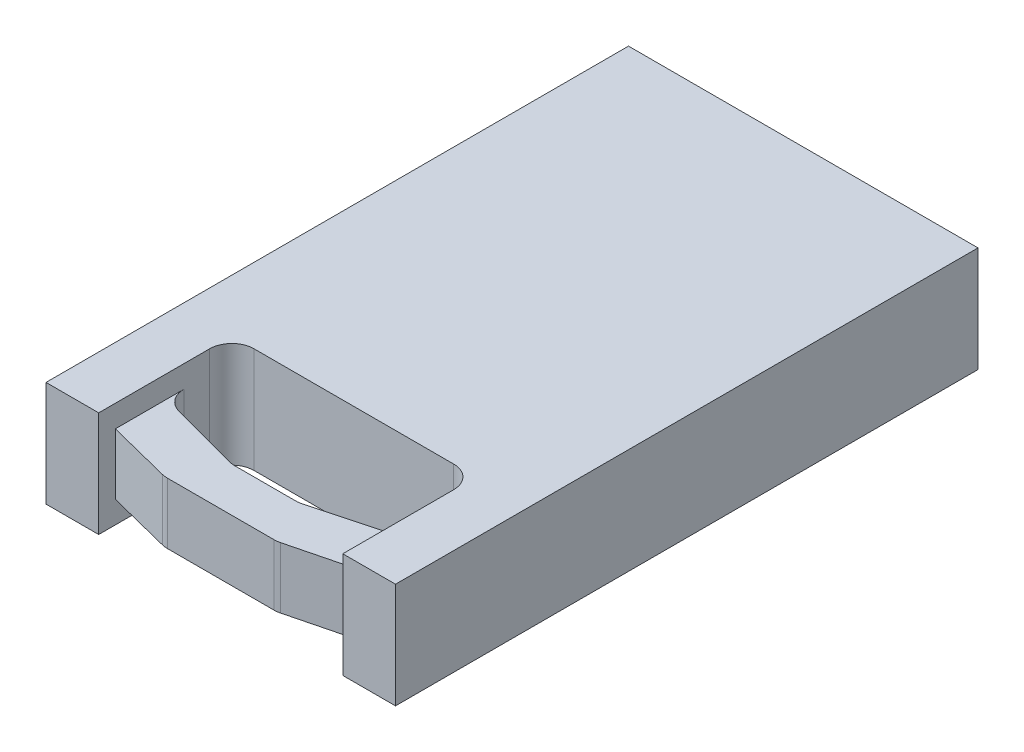
ISO-10303-21;
HEADER;
FILE_DESCRIPTION(('STEP AP214'),'2;1');
FILE_NAME('part.step','',(''),(''),'','','');
FILE_SCHEMA(('AUTOMOTIVE_DESIGN { 1 0 10303 214 1 1 1 1 }'));
ENDSEC;
DATA;
#1=APPLICATION_CONTEXT('core data for automotive mechanical design processes');
#2=APPLICATION_PROTOCOL_DEFINITION('international standard','automotive_design',2000,#1);
#3=PRODUCT_CONTEXT('',#1,'mechanical');
#4=PRODUCT('Part','Part','',(#3));
#5=PRODUCT_RELATED_PRODUCT_CATEGORY('part','',(#4));
#6=PRODUCT_DEFINITION_FORMATION('','',#4);
#7=PRODUCT_DEFINITION_CONTEXT('part definition',#1,'design');
#8=PRODUCT_DEFINITION('design','',#6,#7);
#9=PRODUCT_DEFINITION_SHAPE('','',#8);
#10=(LENGTH_UNIT() NAMED_UNIT(*) SI_UNIT(.MILLI.,.METRE.));
#11=(NAMED_UNIT(*) PLANE_ANGLE_UNIT() SI_UNIT($,.RADIAN.));
#12=(NAMED_UNIT(*) SI_UNIT($,.STERADIAN.) SOLID_ANGLE_UNIT());
#13=UNCERTAINTY_MEASURE_WITH_UNIT(LENGTH_MEASURE(1.E-05),#10,'distance_accuracy_value','');
#14=(GEOMETRIC_REPRESENTATION_CONTEXT(3) GLOBAL_UNCERTAINTY_ASSIGNED_CONTEXT((#13)) GLOBAL_UNIT_ASSIGNED_CONTEXT((#10,
#11,#12)) REPRESENTATION_CONTEXT('',''));
#15=CARTESIAN_POINT('',(0.,0.,0.));
#16=DIRECTION('',(0.,0.,1.));
#17=DIRECTION('',(1.,0.,0.));
#18=AXIS2_PLACEMENT_3D('',#15,#16,#17);
#19=CARTESIAN_POINT('',(-209.55,60.325,166.6875));
#20=DIRECTION('',(0.,0.,-1.));
#21=DIRECTION('',(-1.,0.,0.));
#22=AXIS2_PLACEMENT_3D('',#19,#20,#21);
#23=PLANE('',#22);
#24=DIRECTION('',(0.,1.,0.));
#25=VECTOR('',#24,1.);
#26=CARTESIAN_POINT('',(-100.0125,0.,166.6875));
#27=LINE('',#26,#25);
#28=CARTESIAN_POINT('',(-100.0125,0.,166.6875));
#29=VERTEX_POINT('',#28);
#30=CARTESIAN_POINT('',(-100.0125,60.325,166.6875));
#31=VERTEX_POINT('',#30);
#32=EDGE_CURVE('E382',#29,#31,#27,.T.);
#33=ORIENTED_EDGE('',*,*,#32,.F.);
#34=DIRECTION('',(1.,0.,0.));
#35=VECTOR('',#34,1.);
#36=CARTESIAN_POINT('',(-209.55,0.,166.6875));
#37=LINE('',#36,#35);
#38=CARTESIAN_POINT('',(-69.85,0.,166.6875));
#39=VERTEX_POINT('',#38);
#40=EDGE_CURVE('E215',#29,#39,#37,.T.);
#41=ORIENTED_EDGE('',*,*,#40,.T.);
#42=DIRECTION('',(0.,1.,0.));
#43=VECTOR('',#42,1.);
#44=CARTESIAN_POINT('',(-69.85,0.,166.6875));
#45=LINE('',#44,#43);
#46=CARTESIAN_POINT('',(-69.85,60.325,166.6875));
#47=VERTEX_POINT('',#46);
#48=EDGE_CURVE('E336',#39,#47,#45,.T.);
#49=ORIENTED_EDGE('',*,*,#48,.T.);
#50=DIRECTION('',(1.,0.,0.));
#51=VECTOR('',#50,1.);
#52=CARTESIAN_POINT('',(-209.55,60.325,166.6875));
#53=LINE('',#52,#51);
#54=EDGE_CURVE('E221',#31,#47,#53,.T.);
#55=ORIENTED_EDGE('',*,*,#54,.F.);
#56=EDGE_LOOP('',(#33,#41,#49,#55));
#57=FACE_BOUND('',#56,.T.);
#58=ADVANCED_FACE('F33',(#57),#23,.F.);
#59=DIRECTION('',(0.,1.,0.));
#60=VECTOR('',#59,1.);
#61=CARTESIAN_POINT('',(100.0125,0.,166.6875));
#62=LINE('',#61,#60);
#63=CARTESIAN_POINT('',(100.0125,0.,166.6875));
#64=VERTEX_POINT('',#63);
#65=CARTESIAN_POINT('',(100.0125,60.325,166.6875));
#66=VERTEX_POINT('',#65);
#67=EDGE_CURVE('E48',#64,#66,#62,.T.);
#68=ORIENTED_EDGE('',*,*,#67,.T.);
#69=CARTESIAN_POINT('',(69.8500000000001,60.325,166.6875));
#70=VERTEX_POINT('',#69);
#71=EDGE_CURVE('E352',#70,#66,#53,.T.);
#72=ORIENTED_EDGE('',*,*,#71,.F.);
#73=DIRECTION('',(0.,1.,0.));
#74=VECTOR('',#73,1.);
#75=CARTESIAN_POINT('',(69.8500000000001,0.,166.6875));
#76=LINE('',#75,#74);
#77=CARTESIAN_POINT('',(69.8500000000001,0.,166.6875));
#78=VERTEX_POINT('',#77);
#79=EDGE_CURVE('E343',#78,#70,#76,.T.);
#80=ORIENTED_EDGE('',*,*,#79,.F.);
#81=EDGE_CURVE('E212',#78,#64,#37,.T.);
#82=ORIENTED_EDGE('',*,*,#81,.T.);
#83=EDGE_LOOP('',(#68,#72,#80,#82));
#84=FACE_BOUND('',#83,.T.);
#85=ADVANCED_FACE('F380',(#84),#23,.F.);
#86=CARTESIAN_POINT('',(-209.55,60.325,-166.6875));
#87=DIRECTION('',(0.,0.,1.));
#88=DIRECTION('',(1.,0.,0.));
#89=AXIS2_PLACEMENT_3D('',#86,#87,#88);
#90=PLANE('',#89);
#91=DIRECTION('',(0.,1.,0.));
#92=VECTOR('',#91,1.);
#93=CARTESIAN_POINT('',(100.0125,0.,-166.6875));
#94=LINE('',#93,#92);
#95=CARTESIAN_POINT('',(100.0125,0.,-166.6875));
#96=VERTEX_POINT('',#95);
#97=CARTESIAN_POINT('',(100.0125,60.325,-166.6875));
#98=VERTEX_POINT('',#97);
#99=EDGE_CURVE('E193',#96,#98,#94,.T.);
#100=ORIENTED_EDGE('',*,*,#99,.F.);
#101=DIRECTION('',(-1.,0.,0.));
#102=VECTOR('',#101,1.);
#103=CARTESIAN_POINT('',(-209.55,0.,-166.6875));
#104=LINE('',#103,#102);
#105=CARTESIAN_POINT('',(-100.0125,0.,-166.6875));
#106=VERTEX_POINT('',#105);
#107=EDGE_CURVE('E206',#96,#106,#104,.T.);
#108=ORIENTED_EDGE('',*,*,#107,.T.);
#109=DIRECTION('',(0.,1.,0.));
#110=VECTOR('',#109,1.);
#111=CARTESIAN_POINT('',(-100.0125,0.,-166.6875));
#112=LINE('',#111,#110);
#113=CARTESIAN_POINT('',(-100.0125,60.325,-166.6875));
#114=VERTEX_POINT('',#113);
#115=EDGE_CURVE('E56',#106,#114,#112,.T.);
#116=ORIENTED_EDGE('',*,*,#115,.T.);
#117=DIRECTION('',(-1.,0.,0.));
#118=VECTOR('',#117,1.);
#119=CARTESIAN_POINT('',(-209.55,60.325,-166.6875));
#120=LINE('',#119,#118);
#121=EDGE_CURVE('E208',#98,#114,#120,.T.);
#122=ORIENTED_EDGE('',*,*,#121,.F.);
#123=EDGE_LOOP('',(#100,#108,#116,#122));
#124=FACE_BOUND('',#123,.T.);
#125=ADVANCED_FACE('F205',(#124),#90,.F.);
#126=CARTESIAN_POINT('',(0.,60.325,0.));
#127=DIRECTION('',(0.,-1.,0.));
#128=DIRECTION('',(0.,0.,-1.));
#129=AXIS2_PLACEMENT_3D('',#126,#127,#128);
#130=PLANE('',#129);
#131=DIRECTION('',(0.,0.,-1.));
#132=VECTOR('',#131,1.);
#133=CARTESIAN_POINT('',(100.0125,60.325,166.6875));
#134=LINE('',#133,#132);
#135=EDGE_CURVE('E530',#66,#98,#134,.T.);
#136=ORIENTED_EDGE('',*,*,#135,.T.);
#137=ORIENTED_EDGE('',*,*,#121,.T.);
#138=DIRECTION('',(0.,0.,1.));
#139=VECTOR('',#138,1.);
#140=CARTESIAN_POINT('',(-100.0125,60.325,166.6875));
#141=LINE('',#140,#139);
#142=EDGE_CURVE('E200',#114,#31,#141,.T.);
#143=ORIENTED_EDGE('',*,*,#142,.T.);
#144=ORIENTED_EDGE('',*,*,#54,.T.);
#145=DIRECTION('',(0.,0.,1.));
#146=VECTOR('',#145,1.);
#147=CARTESIAN_POINT('',(-69.85,60.325,166.6875));
#148=LINE('',#147,#146);
#149=CARTESIAN_POINT('',(-69.85,60.325,103.1875));
#150=VERTEX_POINT('',#149);
#151=EDGE_CURVE('E340',#150,#47,#148,.T.);
#152=ORIENTED_EDGE('',*,*,#151,.F.);
#153=CARTESIAN_POINT('',(-57.15,60.325,103.1875));
#154=DIRECTION('',(0.,-1.,0.));
#155=DIRECTION('',(0.,0.,-1.));
#156=AXIS2_PLACEMENT_3D('',#153,#154,#155);
#157=CIRCLE('',#156,12.7);
#158=CARTESIAN_POINT('',(-57.15,60.325,90.4875));
#159=VERTEX_POINT('',#158);
#160=EDGE_CURVE('E270',#150,#159,#157,.T.);
#161=ORIENTED_EDGE('',*,*,#160,.T.);
#162=DIRECTION('',(-1.,0.,0.));
#163=VECTOR('',#162,1.);
#164=CARTESIAN_POINT('',(-69.85,60.325,90.4875));
#165=LINE('',#164,#163);
#166=CARTESIAN_POINT('',(57.15,60.325,90.4875));
#167=VERTEX_POINT('',#166);
#168=EDGE_CURVE('E218',#167,#159,#165,.T.);
#169=ORIENTED_EDGE('',*,*,#168,.F.);
#170=CARTESIAN_POINT('',(57.15,60.325,103.1875));
#171=DIRECTION('',(0.,-1.,0.));
#172=DIRECTION('',(0.,0.,-1.));
#173=AXIS2_PLACEMENT_3D('',#170,#171,#172);
#174=CIRCLE('',#173,12.7);
#175=CARTESIAN_POINT('',(69.85,60.325,103.1875));
#176=VERTEX_POINT('',#175);
#177=EDGE_CURVE('E265',#167,#176,#174,.T.);
#178=ORIENTED_EDGE('',*,*,#177,.T.);
#179=DIRECTION('',(0.,0.,-1.));
#180=VECTOR('',#179,1.);
#181=CARTESIAN_POINT('',(69.8500000000001,60.325,166.6875));
#182=LINE('',#181,#180);
#183=EDGE_CURVE('E332',#70,#176,#182,.T.);
#184=ORIENTED_EDGE('',*,*,#183,.F.);
#185=ORIENTED_EDGE('',*,*,#71,.T.);
#186=EDGE_LOOP('',(#136,#137,#143,#144,#152,#161,#169,#178,#184,#185));
#187=FACE_BOUND('',#186,.T.);
#188=ADVANCED_FACE('F359',(#187),#130,.F.);
#189=CARTESIAN_POINT('',(0.,0.,0.));
#190=DIRECTION('',(0.,-1.,0.));
#191=DIRECTION('',(0.,0.,-1.));
#192=AXIS2_PLACEMENT_3D('',#189,#190,#191);
#193=PLANE('',#192);
#194=ORIENTED_EDGE('',*,*,#107,.F.);
#195=DIRECTION('',(0.,0.,-1.));
#196=VECTOR('',#195,1.);
#197=CARTESIAN_POINT('',(100.0125,0.,166.6875));
#198=LINE('',#197,#196);
#199=EDGE_CURVE('E190',#64,#96,#198,.T.);
#200=ORIENTED_EDGE('',*,*,#199,.F.);
#201=ORIENTED_EDGE('',*,*,#81,.F.);
#202=DIRECTION('',(0.,0.,-1.));
#203=VECTOR('',#202,1.);
#204=CARTESIAN_POINT('',(69.8500000000001,0.,166.6875));
#205=LINE('',#204,#203);
#206=CARTESIAN_POINT('',(69.85,0.,103.1875));
#207=VERTEX_POINT('',#206);
#208=EDGE_CURVE('E347',#78,#207,#205,.T.);
#209=ORIENTED_EDGE('',*,*,#208,.T.);
#210=CARTESIAN_POINT('',(57.15,0.,103.1875));
#211=DIRECTION('',(0.,-1.,0.));
#212=DIRECTION('',(0.,0.,-1.));
#213=AXIS2_PLACEMENT_3D('',#210,#211,#212);
#214=CIRCLE('',#213,12.7);
#215=CARTESIAN_POINT('',(57.15,0.,90.4875));
#216=VERTEX_POINT('',#215);
#217=EDGE_CURVE('E268',#207,#216,#214,.F.);
#218=ORIENTED_EDGE('',*,*,#217,.T.);
#219=DIRECTION('',(-1.,0.,0.));
#220=VECTOR('',#219,1.);
#221=CARTESIAN_POINT('',(-69.85,0.,90.4875));
#222=LINE('',#221,#220);
#223=CARTESIAN_POINT('',(-57.15,0.,90.4875));
#224=VERTEX_POINT('',#223);
#225=EDGE_CURVE('E213',#216,#224,#222,.T.);
#226=ORIENTED_EDGE('',*,*,#225,.T.);
#227=CARTESIAN_POINT('',(-57.15,0.,103.1875));
#228=DIRECTION('',(0.,-1.,0.));
#229=DIRECTION('',(0.,0.,-1.));
#230=AXIS2_PLACEMENT_3D('',#227,#228,#229);
#231=CIRCLE('',#230,12.7);
#232=CARTESIAN_POINT('',(-69.85,0.,103.1875));
#233=VERTEX_POINT('',#232);
#234=EDGE_CURVE('E272',#224,#233,#231,.F.);
#235=ORIENTED_EDGE('',*,*,#234,.T.);
#236=DIRECTION('',(0.,0.,1.));
#237=VECTOR('',#236,1.);
#238=CARTESIAN_POINT('',(-69.85,0.,166.6875));
#239=LINE('',#238,#237);
#240=EDGE_CURVE('E337',#233,#39,#239,.T.);
#241=ORIENTED_EDGE('',*,*,#240,.T.);
#242=ORIENTED_EDGE('',*,*,#40,.F.);
#243=DIRECTION('',(0.,0.,1.));
#244=VECTOR('',#243,1.);
#245=CARTESIAN_POINT('',(-100.0125,0.,166.6875));
#246=LINE('',#245,#244);
#247=EDGE_CURVE('E199',#106,#29,#246,.T.);
#248=ORIENTED_EDGE('',*,*,#247,.F.);
#249=EDGE_LOOP('',(#194,#200,#201,#209,#218,#226,#235,#241,#242,#248));
#250=FACE_BOUND('',#249,.T.);
#251=ADVANCED_FACE('F210',(#250),#193,.T.);
#252=DIRECTION('',(-1.,0.,0.));
#253=VECTOR('',#252,1.);
#254=CARTESIAN_POINT('',(-69.85,12.7,166.6875));
#255=LINE('',#254,#253);
#256=CARTESIAN_POINT('',(30.5887182557428,12.7,166.6875));
#257=VERTEX_POINT('',#256);
#258=CARTESIAN_POINT('',(-30.588718255743,12.7,166.6875));
#259=VERTEX_POINT('',#258);
#260=EDGE_CURVE('E392',#257,#259,#255,.T.);
#261=ORIENTED_EDGE('',*,*,#260,.F.);
#262=DIRECTION('',(0.,1.,0.));
#263=VECTOR('',#262,1.);
#264=CARTESIAN_POINT('',(30.5887182557428,60.325,166.6875));
#265=LINE('',#264,#263);
#266=CARTESIAN_POINT('',(30.5887182557428,47.625,166.6875));
#267=VERTEX_POINT('',#266);
#268=EDGE_CURVE('E227',#257,#267,#265,.T.);
#269=ORIENTED_EDGE('',*,*,#268,.T.);
#270=DIRECTION('',(1.,0.,0.));
#271=VECTOR('',#270,1.);
#272=CARTESIAN_POINT('',(-69.85,47.625,166.6875));
#273=LINE('',#272,#271);
#274=CARTESIAN_POINT('',(-30.588718255743,47.625,166.6875));
#275=VERTEX_POINT('',#274);
#276=EDGE_CURVE('E297',#275,#267,#273,.T.);
#277=ORIENTED_EDGE('',*,*,#276,.F.);
#278=DIRECTION('',(0.,1.,0.));
#279=VECTOR('',#278,1.);
#280=CARTESIAN_POINT('',(-30.588718255743,60.325,166.6875));
#281=LINE('',#280,#279);
#282=EDGE_CURVE('E224',#275,#259,#281,.F.);
#283=ORIENTED_EDGE('',*,*,#282,.T.);
#284=EDGE_LOOP('',(#261,#269,#277,#283));
#285=FACE_BOUND('',#284,.T.);
#286=ADVANCED_FACE('F464',(#285),#23,.F.);
#287=CARTESIAN_POINT('',(69.85,0.,157.1625));
#288=DIRECTION('',(-0.245071510184318,0.,-0.969505005090731));
#289=DIRECTION('',(-0.969505005090731,0.,0.245071510184318));
#290=AXIS2_PLACEMENT_3D('',#287,#288,#289);
#291=PLANE('',#290);
#292=DIRECTION('',(-0.969505005090731,0.,0.245071510184318));
#293=VECTOR('',#292,1.);
#294=CARTESIAN_POINT('',(69.85,12.7,157.1625));
#295=LINE('',#294,#293);
#296=CARTESIAN_POINT('',(69.85,12.7,157.1625));
#297=VERTEX_POINT('',#296);
#298=CARTESIAN_POINT('',(33.7011264350836,12.7,166.300213564652));
#299=VERTEX_POINT('',#298);
#300=EDGE_CURVE('E298',#297,#299,#295,.T.);
#301=ORIENTED_EDGE('',*,*,#300,.F.);
#302=DIRECTION('',(0.,1.,0.));
#303=VECTOR('',#302,1.);
#304=CARTESIAN_POINT('',(69.85,0.,157.1625));
#305=LINE('',#304,#303);
#306=CARTESIAN_POINT('',(69.8500000000001,47.625,157.1625));
#307=VERTEX_POINT('',#306);
#308=EDGE_CURVE('E349',#297,#307,#305,.T.);
#309=ORIENTED_EDGE('',*,*,#308,.T.);
#310=DIRECTION('',(-0.969505005090731,0.,0.245071510184318));
#311=VECTOR('',#310,1.);
#312=CARTESIAN_POINT('',(69.85,47.625,157.1625));
#313=LINE('',#312,#311);
#314=CARTESIAN_POINT('',(33.7011264350836,47.625,166.300213564652));
#315=VERTEX_POINT('',#314);
#316=EDGE_CURVE('E330',#307,#315,#313,.T.);
#317=ORIENTED_EDGE('',*,*,#316,.T.);
#318=DIRECTION('',(0.,1.,0.));
#319=VECTOR('',#318,1.);
#320=CARTESIAN_POINT('',(33.7011264350836,0.,166.300213564652));
#321=LINE('',#320,#319);
#322=EDGE_CURVE('E229',#315,#299,#321,.F.);
#323=ORIENTED_EDGE('',*,*,#322,.T.);
#324=EDGE_LOOP('',(#301,#309,#317,#323));
#325=FACE_BOUND('',#324,.T.);
#326=ADVANCED_FACE('F420',(#325),#291,.F.);
#327=CARTESIAN_POINT('',(-69.85,0.,157.1625));
#328=DIRECTION('',(0.245071510184315,0.,-0.969505005090731));
#329=DIRECTION('',(-0.969505005090731,0.,-0.245071510184316));
#330=AXIS2_PLACEMENT_3D('',#327,#328,#329);
#331=PLANE('',#330);
#332=DIRECTION('',(-0.969505005090731,0.,-0.245071510184316));
#333=VECTOR('',#332,1.);
#334=CARTESIAN_POINT('',(-69.85,12.7,157.1625));
#335=LINE('',#334,#333);
#336=CARTESIAN_POINT('',(-33.7011264350838,12.7,166.300213564652));
#337=VERTEX_POINT('',#336);
#338=CARTESIAN_POINT('',(-69.85,12.7,157.1625));
#339=VERTEX_POINT('',#338);
#340=EDGE_CURVE('E409',#337,#339,#335,.T.);
#341=ORIENTED_EDGE('',*,*,#340,.F.);
#342=DIRECTION('',(0.,1.,0.));
#343=VECTOR('',#342,1.);
#344=CARTESIAN_POINT('',(-33.7011264350838,0.,166.300213564652));
#345=LINE('',#344,#343);
#346=CARTESIAN_POINT('',(-33.7011264350838,47.625,166.300213564652));
#347=VERTEX_POINT('',#346);
#348=EDGE_CURVE('E232',#337,#347,#345,.T.);
#349=ORIENTED_EDGE('',*,*,#348,.T.);
#350=DIRECTION('',(-0.969505005090731,0.,-0.245071510184316));
#351=VECTOR('',#350,1.);
#352=CARTESIAN_POINT('',(-69.85,47.625,157.1625));
#353=LINE('',#352,#351);
#354=CARTESIAN_POINT('',(-69.85,47.625,157.1625));
#355=VERTEX_POINT('',#354);
#356=EDGE_CURVE('E326',#347,#355,#353,.T.);
#357=ORIENTED_EDGE('',*,*,#356,.T.);
#358=DIRECTION('',(0.,1.,0.));
#359=VECTOR('',#358,1.);
#360=CARTESIAN_POINT('',(-69.85,0.,157.1625));
#361=LINE('',#360,#359);
#362=EDGE_CURVE('E296',#339,#355,#361,.T.);
#363=ORIENTED_EDGE('',*,*,#362,.F.);
#364=EDGE_LOOP('',(#341,#349,#357,#363));
#365=FACE_BOUND('',#364,.T.);
#366=ADVANCED_FACE('F456',(#365),#331,.F.);
#367=CARTESIAN_POINT('',(-69.85,0.,141.2875));
#368=DIRECTION('',(0.,0.,1.));
#369=DIRECTION('',(1.,0.,0.));
#370=AXIS2_PLACEMENT_3D('',#367,#368,#369);
#371=PLANE('',#370);
#372=DIRECTION('',(1.,0.,0.));
#373=VECTOR('',#372,1.);
#374=CARTESIAN_POINT('',(-69.85,12.7,141.2875));
#375=LINE('',#374,#373);
#376=CARTESIAN_POINT('',(-17.3780132806406,12.7,141.2875));
#377=VERTEX_POINT('',#376);
#378=CARTESIAN_POINT('',(17.3780132806408,12.7,141.2875));
#379=VERTEX_POINT('',#378);
#380=EDGE_CURVE('E398',#377,#379,#375,.T.);
#381=ORIENTED_EDGE('',*,*,#380,.F.);
#382=DIRECTION('',(0.,-1.,0.));
#383=VECTOR('',#382,1.);
#384=CARTESIAN_POINT('',(-17.3780132806406,60.325,141.2875));
#385=LINE('',#384,#383);
#386=CARTESIAN_POINT('',(-17.3780132806406,47.625,141.2875));
#387=VERTEX_POINT('',#386);
#388=EDGE_CURVE('E244',#377,#387,#385,.F.);
#389=ORIENTED_EDGE('',*,*,#388,.T.);
#390=DIRECTION('',(1.,0.,0.));
#391=VECTOR('',#390,1.);
#392=CARTESIAN_POINT('',(-69.85,47.625,141.2875));
#393=LINE('',#392,#391);
#394=CARTESIAN_POINT('',(17.3780132806408,47.625,141.2875));
#395=VERTEX_POINT('',#394);
#396=EDGE_CURVE('E312',#387,#395,#393,.T.);
#397=ORIENTED_EDGE('',*,*,#396,.T.);
#398=DIRECTION('',(0.,1.,0.));
#399=VECTOR('',#398,1.);
#400=CARTESIAN_POINT('',(17.3780132806408,0.,141.2875));
#401=LINE('',#400,#399);
#402=EDGE_CURVE('E246',#395,#379,#401,.F.);
#403=ORIENTED_EDGE('',*,*,#402,.T.);
#404=EDGE_LOOP('',(#381,#389,#397,#403));
#405=FACE_BOUND('',#404,.T.);
#406=ADVANCED_FACE('F444',(#405),#371,.F.);
#407=CARTESIAN_POINT('',(69.85,0.,127.675681024499));
#408=DIRECTION('',(-0.258819045102526,0.,-0.965925826289067));
#409=DIRECTION('',(0.,-1.,0.));
#410=AXIS2_PLACEMENT_3D('',#407,#408,#409);
#411=PLANE('',#410);
#412=DIRECTION('',(-0.965925826289067,0.,0.258819045102526));
#413=VECTOR('',#412,1.);
#414=CARTESIAN_POINT('',(69.85,12.7,127.675681024499));
#415=LINE('',#414,#413);
#416=CARTESIAN_POINT('',(20.6650151534429,12.7,140.854757993871));
#417=VERTEX_POINT('',#416);
#418=CARTESIAN_POINT('',(60.4370018728021,12.7,130.197886271037));
#419=VERTEX_POINT('',#418);
#420=EDGE_CURVE('E402',#417,#419,#415,.F.);
#421=ORIENTED_EDGE('',*,*,#420,.F.);
#422=DIRECTION('',(0.,-1.,0.));
#423=VECTOR('',#422,1.);
#424=CARTESIAN_POINT('',(20.6650151534429,60.325,140.854757993871));
#425=LINE('',#424,#423);
#426=CARTESIAN_POINT('',(20.6650151534429,47.625,140.854757993871));
#427=VERTEX_POINT('',#426);
#428=EDGE_CURVE('E239',#417,#427,#425,.F.);
#429=ORIENTED_EDGE('',*,*,#428,.T.);
#430=DIRECTION('',(-0.965925826289067,0.,0.258819045102526));
#431=VECTOR('',#430,1.);
#432=CARTESIAN_POINT('',(69.85,47.625,127.675681024499));
#433=LINE('',#432,#431);
#434=CARTESIAN_POINT('',(60.4370018728021,47.625,130.197886271037));
#435=VERTEX_POINT('',#434);
#436=EDGE_CURVE('E318',#427,#435,#433,.F.);
#437=ORIENTED_EDGE('',*,*,#436,.T.);
#438=DIRECTION('',(0.,1.,0.));
#439=VECTOR('',#438,1.);
#440=CARTESIAN_POINT('',(60.4370018728021,0.,130.197886271037));
#441=LINE('',#440,#439);
#442=EDGE_CURVE('E241',#435,#419,#441,.F.);
#443=ORIENTED_EDGE('',*,*,#442,.T.);
#444=EDGE_LOOP('',(#421,#429,#437,#443));
#445=FACE_BOUND('',#444,.T.);
#446=ADVANCED_FACE('F435',(#445),#411,.T.);
#447=CARTESIAN_POINT('',(-19.0500000000006,0.,141.2875));
#448=DIRECTION('',(0.258819045102524,0.,-0.965925826289067));
#449=DIRECTION('',(0.,-1.,0.));
#450=AXIS2_PLACEMENT_3D('',#447,#448,#449);
#451=PLANE('',#450);
#452=DIRECTION('',(-0.965925826289067,0.,-0.258819045102524));
#453=VECTOR('',#452,1.);
#454=CARTESIAN_POINT('',(-19.0500000000006,12.7,141.2875));
#455=LINE('',#454,#453);
#456=CARTESIAN_POINT('',(-60.4370018728021,12.7,130.197886271037));
#457=VERTEX_POINT('',#456);
#458=CARTESIAN_POINT('',(-20.6650151534427,12.7,140.854757993871));
#459=VERTEX_POINT('',#458);
#460=EDGE_CURVE('E394',#457,#459,#455,.F.);
#461=ORIENTED_EDGE('',*,*,#460,.F.);
#462=DIRECTION('',(0.,-1.,0.));
#463=VECTOR('',#462,1.);
#464=CARTESIAN_POINT('',(-60.4370018728021,60.325,130.197886271037));
#465=LINE('',#464,#463);
#466=CARTESIAN_POINT('',(-60.4370018728021,47.625,130.197886271037));
#467=VERTEX_POINT('',#466);
#468=EDGE_CURVE('E249',#457,#467,#465,.F.);
#469=ORIENTED_EDGE('',*,*,#468,.T.);
#470=DIRECTION('',(-0.965925826289067,0.,-0.258819045102524));
#471=VECTOR('',#470,1.);
#472=CARTESIAN_POINT('',(-19.0500000000006,47.625,141.2875));
#473=LINE('',#472,#471);
#474=CARTESIAN_POINT('',(-20.6650151534427,47.625,140.854757993871));
#475=VERTEX_POINT('',#474);
#476=EDGE_CURVE('E290',#467,#475,#473,.F.);
#477=ORIENTED_EDGE('',*,*,#476,.T.);
#478=DIRECTION('',(0.,1.,0.));
#479=VECTOR('',#478,1.);
#480=CARTESIAN_POINT('',(-20.6650151534427,0.,140.854757993871));
#481=LINE('',#480,#479);
#482=EDGE_CURVE('E251',#475,#459,#481,.F.);
#483=ORIENTED_EDGE('',*,*,#482,.T.);
#484=EDGE_LOOP('',(#461,#469,#477,#483));
#485=FACE_BOUND('',#484,.T.);
#486=ADVANCED_FACE('F452',(#485),#451,.T.);
#487=CARTESIAN_POINT('',(30.5887182557428,60.325,153.9875));
#488=DIRECTION('',(0.,1.,0.));
#489=DIRECTION('',(0.,0.,1.));
#490=AXIS2_PLACEMENT_3D('',#487,#488,#489);
#491=CYLINDRICAL_SURFACE('',#490,12.7);
#492=ORIENTED_EDGE('',*,*,#268,.F.);
#493=CARTESIAN_POINT('',(30.5887182557428,12.7,153.9875));
#494=DIRECTION('',(0.,-1.,0.));
#495=DIRECTION('',(0.,0.,-1.));
#496=AXIS2_PLACEMENT_3D('',#493,#494,#495);
#497=CIRCLE('',#496,12.7);
#498=EDGE_CURVE('E303',#257,#299,#497,.F.);
#499=ORIENTED_EDGE('',*,*,#498,.T.);
#500=ORIENTED_EDGE('',*,*,#322,.F.);
#501=CARTESIAN_POINT('',(30.5887182557428,47.625,153.9875));
#502=DIRECTION('',(0.,-1.,0.));
#503=DIRECTION('',(0.,0.,-1.));
#504=AXIS2_PLACEMENT_3D('',#501,#502,#503);
#505=CIRCLE('',#504,12.7);
#506=EDGE_CURVE('E328',#267,#315,#505,.F.);
#507=ORIENTED_EDGE('',*,*,#506,.F.);
#508=EDGE_LOOP('',(#492,#499,#500,#507));
#509=FACE_BOUND('',#508,.T.);
#510=ADVANCED_FACE('F414',(#509),#491,.T.);
#511=CARTESIAN_POINT('',(-30.588718255743,0.,153.9875));
#512=DIRECTION('',(0.,1.,0.));
#513=DIRECTION('',(0.,0.,1.));
#514=AXIS2_PLACEMENT_3D('',#511,#512,#513);
#515=CYLINDRICAL_SURFACE('',#514,12.7);
#516=ORIENTED_EDGE('',*,*,#348,.F.);
#517=CARTESIAN_POINT('',(-30.588718255743,12.7,153.9875));
#518=DIRECTION('',(0.,-1.,0.));
#519=DIRECTION('',(0.,0.,-1.));
#520=AXIS2_PLACEMENT_3D('',#517,#518,#519);
#521=CIRCLE('',#520,12.7);
#522=EDGE_CURVE('E406',#337,#259,#521,.F.);
#523=ORIENTED_EDGE('',*,*,#522,.T.);
#524=ORIENTED_EDGE('',*,*,#282,.F.);
#525=CARTESIAN_POINT('',(-30.588718255743,47.625,153.9875));
#526=DIRECTION('',(0.,-1.,0.));
#527=DIRECTION('',(0.,0.,-1.));
#528=AXIS2_PLACEMENT_3D('',#525,#526,#527);
#529=CIRCLE('',#528,12.7);
#530=EDGE_CURVE('E324',#347,#275,#529,.F.);
#531=ORIENTED_EDGE('',*,*,#530,.F.);
#532=EDGE_LOOP('',(#516,#523,#524,#531));
#533=FACE_BOUND('',#532,.T.);
#534=ADVANCED_FACE('F462',(#533),#515,.T.);
#535=CARTESIAN_POINT('',(57.15,0.,117.930628277166));
#536=DIRECTION('',(0.,1.,0.));
#537=DIRECTION('',(0.,0.,1.));
#538=AXIS2_PLACEMENT_3D('',#535,#536,#537);
#539=CYLINDRICAL_SURFACE('',#538,12.7);
#540=CARTESIAN_POINT('',(57.15,12.7,117.930628277166));
#541=DIRECTION('',(0.,-1.,0.));
#542=DIRECTION('',(0.,0.,-1.));
#543=AXIS2_PLACEMENT_3D('',#540,#541,#542);
#544=CIRCLE('',#543,12.7);
#545=CARTESIAN_POINT('',(69.85,12.7,117.930628277166));
#546=VERTEX_POINT('',#545);
#547=EDGE_CURVE('E404',#419,#546,#544,.F.);
#548=ORIENTED_EDGE('',*,*,#547,.F.);
#549=ORIENTED_EDGE('',*,*,#442,.F.);
#550=CARTESIAN_POINT('',(57.15,47.625,117.930628277166));
#551=DIRECTION('',(0.,-1.,0.));
#552=DIRECTION('',(0.,0.,-1.));
#553=AXIS2_PLACEMENT_3D('',#550,#551,#552);
#554=CIRCLE('',#553,12.7);
#555=CARTESIAN_POINT('',(69.8500000000001,47.625,117.930628277166));
#556=VERTEX_POINT('',#555);
#557=EDGE_CURVE('E321',#435,#556,#554,.F.);
#558=ORIENTED_EDGE('',*,*,#557,.T.);
#559=DIRECTION('',(0.,-1.,0.));
#560=VECTOR('',#559,1.);
#561=CARTESIAN_POINT('',(69.85,60.325,117.930628277166));
#562=LINE('',#561,#560);
#563=EDGE_CURVE('E237',#546,#556,#562,.F.);
#564=ORIENTED_EDGE('',*,*,#563,.F.);
#565=EDGE_LOOP('',(#548,#549,#558,#564));
#566=FACE_BOUND('',#565,.T.);
#567=ADVANCED_FACE('F430',(#566),#539,.F.);
#568=CARTESIAN_POINT('',(17.3780132806408,0.,128.5875));
#569=DIRECTION('',(0.,-1.,0.));
#570=DIRECTION('',(0.,0.,-1.));
#571=AXIS2_PLACEMENT_3D('',#568,#569,#570);
#572=CYLINDRICAL_SURFACE('',#571,12.7);
#573=CARTESIAN_POINT('',(17.3780132806408,12.7,128.5875));
#574=DIRECTION('',(0.,-1.,0.));
#575=DIRECTION('',(0.,0.,-1.));
#576=AXIS2_PLACEMENT_3D('',#573,#574,#575);
#577=CIRCLE('',#576,12.7);
#578=EDGE_CURVE('E400',#379,#417,#577,.F.);
#579=ORIENTED_EDGE('',*,*,#578,.F.);
#580=ORIENTED_EDGE('',*,*,#402,.F.);
#581=CARTESIAN_POINT('',(17.3780132806408,47.625,128.5875));
#582=DIRECTION('',(0.,-1.,0.));
#583=DIRECTION('',(0.,0.,-1.));
#584=AXIS2_PLACEMENT_3D('',#581,#582,#583);
#585=CIRCLE('',#584,12.7);
#586=EDGE_CURVE('E315',#395,#427,#585,.F.);
#587=ORIENTED_EDGE('',*,*,#586,.T.);
#588=ORIENTED_EDGE('',*,*,#428,.F.);
#589=EDGE_LOOP('',(#579,#580,#587,#588));
#590=FACE_BOUND('',#589,.T.);
#591=ADVANCED_FACE('F439',(#590),#572,.F.);
#592=CARTESIAN_POINT('',(-17.3780132806406,0.,128.5875));
#593=DIRECTION('',(0.,1.,0.));
#594=DIRECTION('',(0.,0.,1.));
#595=AXIS2_PLACEMENT_3D('',#592,#593,#594);
#596=CYLINDRICAL_SURFACE('',#595,12.7);
#597=CARTESIAN_POINT('',(-17.3780132806406,12.7,128.5875));
#598=DIRECTION('',(0.,-1.,0.));
#599=DIRECTION('',(0.,0.,-1.));
#600=AXIS2_PLACEMENT_3D('',#597,#598,#599);
#601=CIRCLE('',#600,12.7);
#602=EDGE_CURVE('E396',#459,#377,#601,.F.);
#603=ORIENTED_EDGE('',*,*,#602,.F.);
#604=ORIENTED_EDGE('',*,*,#482,.F.);
#605=CARTESIAN_POINT('',(-17.3780132806406,47.625,128.5875));
#606=DIRECTION('',(0.,-1.,0.));
#607=DIRECTION('',(0.,0.,-1.));
#608=AXIS2_PLACEMENT_3D('',#605,#606,#607);
#609=CIRCLE('',#608,12.7);
#610=EDGE_CURVE('E309',#475,#387,#609,.F.);
#611=ORIENTED_EDGE('',*,*,#610,.T.);
#612=ORIENTED_EDGE('',*,*,#388,.F.);
#613=EDGE_LOOP('',(#603,#604,#611,#612));
#614=FACE_BOUND('',#613,.T.);
#615=ADVANCED_FACE('F448',(#614),#596,.F.);
#616=CARTESIAN_POINT('',(-57.15,0.,117.930628277166));
#617=DIRECTION('',(0.,-1.,0.));
#618=DIRECTION('',(0.,0.,-1.));
#619=AXIS2_PLACEMENT_3D('',#616,#617,#618);
#620=CYLINDRICAL_SURFACE('',#619,12.7);
#621=CARTESIAN_POINT('',(-57.15,12.7,117.930628277166));
#622=DIRECTION('',(0.,-1.,0.));
#623=DIRECTION('',(0.,0.,-1.));
#624=AXIS2_PLACEMENT_3D('',#621,#622,#623);
#625=CIRCLE('',#624,12.7);
#626=CARTESIAN_POINT('',(-69.85,12.7,117.930628277166));
#627=VERTEX_POINT('',#626);
#628=EDGE_CURVE('E12',#627,#457,#625,.F.);
#629=ORIENTED_EDGE('',*,*,#628,.F.);
#630=DIRECTION('',(0.,1.,0.));
#631=VECTOR('',#630,1.);
#632=CARTESIAN_POINT('',(-69.85,0.,117.930628277166));
#633=LINE('',#632,#631);
#634=CARTESIAN_POINT('',(-69.85,47.625,117.930628277166));
#635=VERTEX_POINT('',#634);
#636=EDGE_CURVE('E257',#635,#627,#633,.F.);
#637=ORIENTED_EDGE('',*,*,#636,.F.);
#638=CARTESIAN_POINT('',(-57.15,47.625,117.930628277166));
#639=DIRECTION('',(0.,-1.,0.));
#640=DIRECTION('',(0.,0.,-1.));
#641=AXIS2_PLACEMENT_3D('',#638,#639,#640);
#642=CIRCLE('',#641,12.7);
#643=EDGE_CURVE('E41',#635,#467,#642,.F.);
#644=ORIENTED_EDGE('',*,*,#643,.T.);
#645=ORIENTED_EDGE('',*,*,#468,.F.);
#646=EDGE_LOOP('',(#629,#637,#644,#645));
#647=FACE_BOUND('',#646,.T.);
#648=ADVANCED_FACE('F279',(#647),#620,.F.);
#649=CARTESIAN_POINT('',(69.85,0.,141.2875));
#650=DIRECTION('',(1.,0.,0.));
#651=DIRECTION('',(0.,0.,-1.));
#652=AXIS2_PLACEMENT_3D('',#649,#650,#651);
#653=PLANE('',#652);
#654=ORIENTED_EDGE('',*,*,#308,.F.);
#655=DIRECTION('',(0.,0.,1.));
#656=VECTOR('',#655,1.);
#657=CARTESIAN_POINT('',(69.85,12.7,166.6875));
#658=LINE('',#657,#656);
#659=EDGE_CURVE('E384',#546,#297,#658,.T.);
#660=ORIENTED_EDGE('',*,*,#659,.F.);
#661=ORIENTED_EDGE('',*,*,#563,.T.);
#662=DIRECTION('',(0.,0.,-1.));
#663=VECTOR('',#662,1.);
#664=CARTESIAN_POINT('',(69.8500000000001,47.625,166.6875));
#665=LINE('',#664,#663);
#666=EDGE_CURVE('E301',#307,#556,#665,.T.);
#667=ORIENTED_EDGE('',*,*,#666,.F.);
#668=EDGE_LOOP('',(#654,#660,#661,#667));
#669=FACE_BOUND('',#668,.T.);
#670=ORIENTED_EDGE('',*,*,#79,.T.);
#671=ORIENTED_EDGE('',*,*,#183,.T.);
#672=DIRECTION('',(0.,1.,0.));
#673=VECTOR('',#672,1.);
#674=CARTESIAN_POINT('',(69.85,0.,103.1875));
#675=LINE('',#674,#673);
#676=EDGE_CURVE('E234',#176,#207,#675,.F.);
#677=ORIENTED_EDGE('',*,*,#676,.T.);
#678=ORIENTED_EDGE('',*,*,#208,.F.);
#679=EDGE_LOOP('',(#670,#671,#677,#678));
#680=FACE_BOUND('',#679,.T.);
#681=ADVANCED_FACE('F425',(#669,#680),#653,.F.);
#682=CARTESIAN_POINT('',(-69.85,0.,141.2875));
#683=DIRECTION('',(-1.,0.,0.));
#684=DIRECTION('',(0.,0.,1.));
#685=AXIS2_PLACEMENT_3D('',#682,#683,#684);
#686=PLANE('',#685);
#687=DIRECTION('',(0.,0.,-1.));
#688=VECTOR('',#687,1.);
#689=CARTESIAN_POINT('',(-69.85,12.7,166.6875));
#690=LINE('',#689,#688);
#691=EDGE_CURVE('E381',#339,#627,#690,.T.);
#692=ORIENTED_EDGE('',*,*,#691,.F.);
#693=ORIENTED_EDGE('',*,*,#362,.T.);
#694=DIRECTION('',(0.,0.,1.));
#695=VECTOR('',#694,1.);
#696=CARTESIAN_POINT('',(-69.85,47.625,166.6875));
#697=LINE('',#696,#695);
#698=EDGE_CURVE('E287',#635,#355,#697,.T.);
#699=ORIENTED_EDGE('',*,*,#698,.F.);
#700=ORIENTED_EDGE('',*,*,#636,.T.);
#701=EDGE_LOOP('',(#692,#693,#699,#700));
#702=FACE_BOUND('',#701,.T.);
#703=ORIENTED_EDGE('',*,*,#240,.F.);
#704=DIRECTION('',(0.,1.,0.));
#705=VECTOR('',#704,1.);
#706=CARTESIAN_POINT('',(-69.85,60.325,103.1875));
#707=LINE('',#706,#705);
#708=EDGE_CURVE('E254',#233,#150,#707,.T.);
#709=ORIENTED_EDGE('',*,*,#708,.T.);
#710=ORIENTED_EDGE('',*,*,#151,.T.);
#711=ORIENTED_EDGE('',*,*,#48,.F.);
#712=EDGE_LOOP('',(#703,#709,#710,#711));
#713=FACE_BOUND('',#712,.T.);
#714=ADVANCED_FACE('F293',(#702,#713),#686,.F.);
#715=CARTESIAN_POINT('',(-69.85,0.,90.4875));
#716=DIRECTION('',(0.,0.,-1.));
#717=DIRECTION('',(-1.,0.,0.));
#718=AXIS2_PLACEMENT_3D('',#715,#716,#717);
#719=PLANE('',#718);
#720=ORIENTED_EDGE('',*,*,#225,.F.);
#721=DIRECTION('',(0.,1.,0.));
#722=VECTOR('',#721,1.);
#723=CARTESIAN_POINT('',(57.15,60.325,90.4875));
#724=LINE('',#723,#722);
#725=EDGE_CURVE('E262',#216,#167,#724,.T.);
#726=ORIENTED_EDGE('',*,*,#725,.T.);
#727=ORIENTED_EDGE('',*,*,#168,.T.);
#728=DIRECTION('',(0.,1.,0.));
#729=VECTOR('',#728,1.);
#730=CARTESIAN_POINT('',(-57.15,0.,90.4875));
#731=LINE('',#730,#729);
#732=EDGE_CURVE('E260',#159,#224,#731,.F.);
#733=ORIENTED_EDGE('',*,*,#732,.T.);
#734=EDGE_LOOP('',(#720,#726,#727,#733));
#735=FACE_BOUND('',#734,.T.);
#736=ADVANCED_FACE('F371',(#735),#719,.F.);
#737=CARTESIAN_POINT('',(57.15,0.,103.1875));
#738=DIRECTION('',(0.,-1.,0.));
#739=DIRECTION('',(0.,0.,-1.));
#740=AXIS2_PLACEMENT_3D('',#737,#738,#739);
#741=CYLINDRICAL_SURFACE('',#740,12.7);
#742=ORIENTED_EDGE('',*,*,#217,.F.);
#743=ORIENTED_EDGE('',*,*,#676,.F.);
#744=ORIENTED_EDGE('',*,*,#177,.F.);
#745=ORIENTED_EDGE('',*,*,#725,.F.);
#746=EDGE_LOOP('',(#742,#743,#744,#745));
#747=FACE_BOUND('',#746,.T.);
#748=ADVANCED_FACE('F375',(#747),#741,.F.);
#749=CARTESIAN_POINT('',(-57.15,0.,103.1875));
#750=DIRECTION('',(0.,-1.,0.));
#751=DIRECTION('',(0.,0.,-1.));
#752=AXIS2_PLACEMENT_3D('',#749,#750,#751);
#753=CYLINDRICAL_SURFACE('',#752,12.7);
#754=ORIENTED_EDGE('',*,*,#234,.F.);
#755=ORIENTED_EDGE('',*,*,#732,.F.);
#756=ORIENTED_EDGE('',*,*,#160,.F.);
#757=ORIENTED_EDGE('',*,*,#708,.F.);
#758=EDGE_LOOP('',(#754,#755,#756,#757));
#759=FACE_BOUND('',#758,.T.);
#760=ADVANCED_FACE('F35',(#759),#753,.F.);
#761=CARTESIAN_POINT('',(0.,47.625,0.));
#762=DIRECTION('',(0.,-1.,0.));
#763=DIRECTION('',(0.,0.,-1.));
#764=AXIS2_PLACEMENT_3D('',#761,#762,#763);
#765=PLANE('',#764);
#766=ORIENTED_EDGE('',*,*,#666,.T.);
#767=ORIENTED_EDGE('',*,*,#557,.F.);
#768=ORIENTED_EDGE('',*,*,#436,.F.);
#769=ORIENTED_EDGE('',*,*,#586,.F.);
#770=ORIENTED_EDGE('',*,*,#396,.F.);
#771=ORIENTED_EDGE('',*,*,#610,.F.);
#772=ORIENTED_EDGE('',*,*,#476,.F.);
#773=ORIENTED_EDGE('',*,*,#643,.F.);
#774=ORIENTED_EDGE('',*,*,#698,.T.);
#775=ORIENTED_EDGE('',*,*,#356,.F.);
#776=ORIENTED_EDGE('',*,*,#530,.T.);
#777=ORIENTED_EDGE('',*,*,#276,.T.);
#778=ORIENTED_EDGE('',*,*,#506,.T.);
#779=ORIENTED_EDGE('',*,*,#316,.F.);
#780=EDGE_LOOP('',(#766,#767,#768,#769,#770,#771,#772,#773,#774,#775,#776,#777,#778,#779));
#781=FACE_BOUND('',#780,.T.);
#782=ADVANCED_FACE('F285',(#781),#765,.F.);
#783=CARTESIAN_POINT('',(0.,12.7,0.));
#784=DIRECTION('',(0.,-1.,0.));
#785=DIRECTION('',(0.,0.,-1.));
#786=AXIS2_PLACEMENT_3D('',#783,#784,#785);
#787=PLANE('',#786);
#788=ORIENTED_EDGE('',*,*,#300,.T.);
#789=ORIENTED_EDGE('',*,*,#498,.F.);
#790=ORIENTED_EDGE('',*,*,#260,.T.);
#791=ORIENTED_EDGE('',*,*,#522,.F.);
#792=ORIENTED_EDGE('',*,*,#340,.T.);
#793=ORIENTED_EDGE('',*,*,#691,.T.);
#794=ORIENTED_EDGE('',*,*,#628,.T.);
#795=ORIENTED_EDGE('',*,*,#460,.T.);
#796=ORIENTED_EDGE('',*,*,#602,.T.);
#797=ORIENTED_EDGE('',*,*,#380,.T.);
#798=ORIENTED_EDGE('',*,*,#578,.T.);
#799=ORIENTED_EDGE('',*,*,#420,.T.);
#800=ORIENTED_EDGE('',*,*,#547,.T.);
#801=ORIENTED_EDGE('',*,*,#659,.T.);
#802=EDGE_LOOP('',(#788,#789,#790,#791,#792,#793,#794,#795,#796,#797,#798,#799,#800,#801));
#803=FACE_BOUND('',#802,.T.);
#804=ADVANCED_FACE('F453',(#803),#787,.T.);
#805=CARTESIAN_POINT('',(-100.0125,0.,166.6875));
#806=DIRECTION('',(-1.,0.,0.));
#807=DIRECTION('',(0.,0.,1.));
#808=AXIS2_PLACEMENT_3D('',#805,#806,#807);
#809=PLANE('',#808);
#810=ORIENTED_EDGE('',*,*,#142,.F.);
#811=ORIENTED_EDGE('',*,*,#115,.F.);
#812=ORIENTED_EDGE('',*,*,#247,.T.);
#813=ORIENTED_EDGE('',*,*,#32,.T.);
#814=EDGE_LOOP('',(#810,#811,#812,#813));
#815=FACE_BOUND('',#814,.T.);
#816=ADVANCED_FACE('F524',(#815),#809,.T.);
#817=CARTESIAN_POINT('',(100.0125,0.,166.6875));
#818=DIRECTION('',(1.,0.,0.));
#819=DIRECTION('',(0.,0.,-1.));
#820=AXIS2_PLACEMENT_3D('',#817,#818,#819);
#821=PLANE('',#820);
#822=ORIENTED_EDGE('',*,*,#135,.F.);
#823=ORIENTED_EDGE('',*,*,#67,.F.);
#824=ORIENTED_EDGE('',*,*,#199,.T.);
#825=ORIENTED_EDGE('',*,*,#99,.T.);
#826=EDGE_LOOP('',(#822,#823,#824,#825));
#827=FACE_BOUND('',#826,.T.);
#828=ADVANCED_FACE('F192',(#827),#821,.T.);
#829=CLOSED_SHELL('',(#58,#85,#125,#188,#251,#286,#326,#366,#406,#446,#486,#510,#534,#567,#591,
#615,#648,#681,#714,#736,#748,#760,#782,#804,#816,#828));
#830=MANIFOLD_SOLID_BREP('B2',#829);
#831=ADVANCED_BREP_SHAPE_REPRESENTATION('',(#18,#830),#14);
#832=SHAPE_DEFINITION_REPRESENTATION(#9,#831);
ENDSEC;
END-ISO-10303-21;
